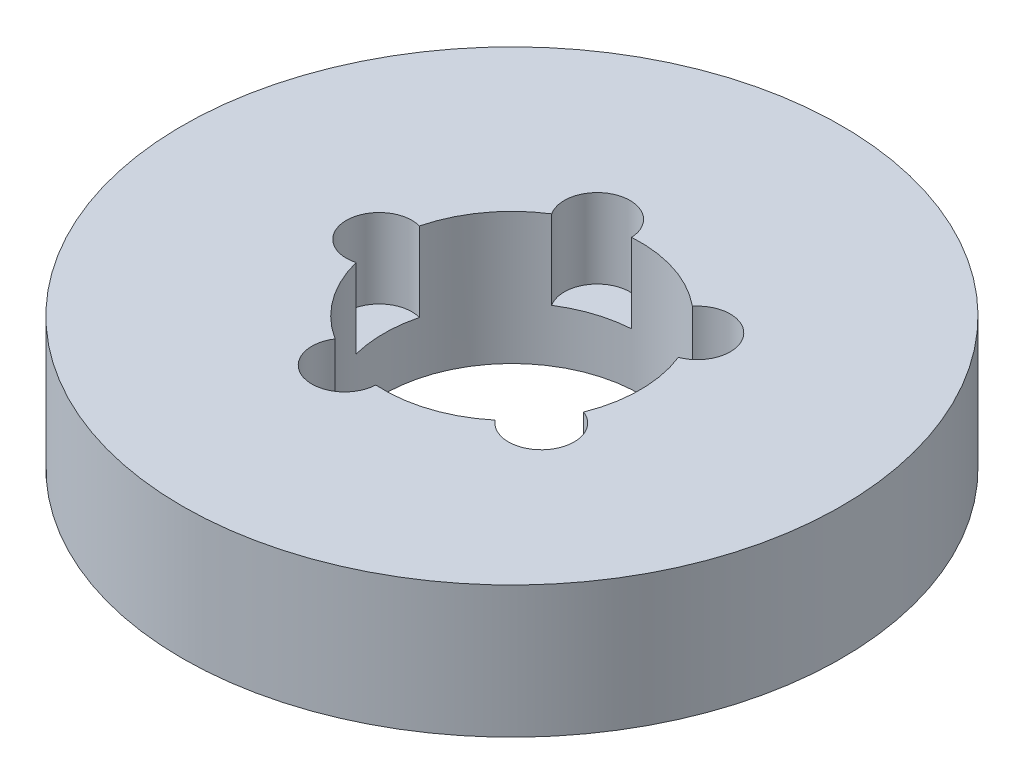
ISO-10303-21;
HEADER;
FILE_DESCRIPTION(('STEP AP214'),'2;1');
FILE_NAME('part.step','',(''),(''),'','','');
FILE_SCHEMA(('AUTOMOTIVE_DESIGN { 1 0 10303 214 1 1 1 1 }'));
ENDSEC;
DATA;
#1=APPLICATION_CONTEXT('core data for automotive mechanical design processes');
#2=APPLICATION_PROTOCOL_DEFINITION('international standard','automotive_design',2000,#1);
#3=PRODUCT_CONTEXT('',#1,'mechanical');
#4=PRODUCT('Part','Part','',(#3));
#5=PRODUCT_RELATED_PRODUCT_CATEGORY('part','',(#4));
#6=PRODUCT_DEFINITION_FORMATION('','',#4);
#7=PRODUCT_DEFINITION_CONTEXT('part definition',#1,'design');
#8=PRODUCT_DEFINITION('design','',#6,#7);
#9=PRODUCT_DEFINITION_SHAPE('','',#8);
#10=(LENGTH_UNIT() NAMED_UNIT(*) SI_UNIT(.MILLI.,.METRE.));
#11=(NAMED_UNIT(*) PLANE_ANGLE_UNIT() SI_UNIT($,.RADIAN.));
#12=(NAMED_UNIT(*) SI_UNIT($,.STERADIAN.) SOLID_ANGLE_UNIT());
#13=UNCERTAINTY_MEASURE_WITH_UNIT(LENGTH_MEASURE(1.E-05),#10,'distance_accuracy_value','');
#14=(GEOMETRIC_REPRESENTATION_CONTEXT(3) GLOBAL_UNCERTAINTY_ASSIGNED_CONTEXT((#13)) GLOBAL_UNIT_ASSIGNED_CONTEXT((#10,
#11,#12)) REPRESENTATION_CONTEXT('',''));
#15=CARTESIAN_POINT('',(0.,0.,0.));
#16=DIRECTION('',(0.,0.,1.));
#17=DIRECTION('',(1.,0.,0.));
#18=AXIS2_PLACEMENT_3D('',#15,#16,#17);
#19=CARTESIAN_POINT('',(0.,18.,0.));
#20=DIRECTION('',(0.,-1.,0.));
#21=DIRECTION('',(0.,0.,-1.));
#22=AXIS2_PLACEMENT_3D('',#19,#20,#21);
#23=CYLINDRICAL_SURFACE('',#22,45.);
#24=CARTESIAN_POINT('',(0.,18.,0.));
#25=DIRECTION('',(0.,1.,0.));
#26=DIRECTION('',(0.,0.,1.));
#27=AXIS2_PLACEMENT_3D('',#24,#25,#26);
#28=CIRCLE('',#27,45.);
#29=CARTESIAN_POINT('',(0.,18.,45.));
#30=VERTEX_POINT('',#29);
#31=EDGE_CURVE('E157',#30,#30,#28,.T.);
#32=ORIENTED_EDGE('',*,*,#31,.F.);
#33=EDGE_LOOP('',(#32));
#34=FACE_BOUND('',#33,.T.);
#35=CARTESIAN_POINT('',(0.,0.,0.));
#36=DIRECTION('',(0.,1.,0.));
#37=DIRECTION('',(0.,0.,1.));
#38=AXIS2_PLACEMENT_3D('',#35,#36,#37);
#39=CIRCLE('',#38,45.);
#40=CARTESIAN_POINT('',(0.,0.,45.));
#41=VERTEX_POINT('',#40);
#42=EDGE_CURVE('E150',#41,#41,#39,.T.);
#43=ORIENTED_EDGE('',*,*,#42,.T.);
#44=EDGE_LOOP('',(#43));
#45=FACE_BOUND('',#44,.T.);
#46=ADVANCED_FACE('F39',(#34,#45),#23,.T.);
#47=CARTESIAN_POINT('',(0.,18.,0.));
#48=DIRECTION('',(0.,1.,0.));
#49=DIRECTION('',(0.,0.,1.));
#50=AXIS2_PLACEMENT_3D('',#47,#48,#49);
#51=PLANE('',#50);
#52=CARTESIAN_POINT('',(-5.60135320478435,18.,-17.239192544268));
#53=DIRECTION('',(0.,1.,0.));
#54=DIRECTION('',(-0.95105651629515,0.,0.309016994374958));
#55=AXIS2_PLACEMENT_3D('',#52,#53,#54);
#56=CIRCLE('',#55,4.48336680824635);
#57=CARTESIAN_POINT('',(-1.123620664871,18.,-17.4638906490357));
#58=VERTEX_POINT('',#57);
#59=CARTESIAN_POINT('',(-9.35598915804041,18.,-14.7890319789576));
#60=VERTEX_POINT('',#59);
#61=EDGE_CURVE('E194',#58,#60,#56,.T.);
#62=ORIENTED_EDGE('',*,*,#61,.F.);
#63=CARTESIAN_POINT('',(0.,18.,0.));
#64=DIRECTION('',(0.,1.,0.));
#65=DIRECTION('',(0.,0.,1.));
#66=AXIS2_PLACEMENT_3D('',#63,#64,#65);
#67=CIRCLE('',#66,17.5);
#68=CARTESIAN_POINT('',(11.1740455842628,18.,-13.4681366669936));
#69=VERTEX_POINT('',#68);
#70=EDGE_CURVE('E147',#69,#58,#67,.T.);
#71=ORIENTED_EDGE('',*,*,#70,.F.);
#72=CARTESIAN_POINT('',(14.664533073118,18.,-10.6544069309616));
#73=DIRECTION('',(0.,1.,0.));
#74=DIRECTION('',(-0.58778525229248,0.,-0.809016994374942));
#75=AXIS2_PLACEMENT_3D('',#72,#73,#74);
#76=CIRCLE('',#75,4.48336680824635);
#77=CARTESIAN_POINT('',(16.2619291209554,18.,-6.46526575362716));
#78=VERTEX_POINT('',#77);
#79=EDGE_CURVE('E254',#78,#69,#76,.T.);
#80=ORIENTED_EDGE('',*,*,#79,.F.);
#81=CARTESIAN_POINT('',(16.2619291209555,18.,6.46526575362693));
#82=VERTEX_POINT('',#81);
#83=EDGE_CURVE('E144',#82,#78,#67,.T.);
#84=ORIENTED_EDGE('',*,*,#83,.F.);
#85=CARTESIAN_POINT('',(14.6645330731181,18.,10.6544069309613));
#86=DIRECTION('',(0.,1.,0.));
#87=DIRECTION('',(0.587785252292469,0.,-0.809016994374951));
#88=AXIS2_PLACEMENT_3D('',#85,#86,#87);
#89=CIRCLE('',#88,4.48336680824635);
#90=CARTESIAN_POINT('',(11.174045584263,18.,13.4681366669934));
#91=VERTEX_POINT('',#90);
#92=EDGE_CURVE('E141',#91,#82,#89,.T.);
#93=ORIENTED_EDGE('',*,*,#92,.F.);
#94=CARTESIAN_POINT('',(-1.12362066487075,18.,17.4638906490357));
#95=VERTEX_POINT('',#94);
#96=EDGE_CURVE('E134',#95,#91,#67,.T.);
#97=ORIENTED_EDGE('',*,*,#96,.F.);
#98=CARTESIAN_POINT('',(-5.60135320478411,18.,17.2391925442681));
#99=DIRECTION('',(0.,1.,0.));
#100=DIRECTION('',(0.951056516295155,0.,0.309016994374945));
#101=AXIS2_PLACEMENT_3D('',#98,#99,#100);
#102=CIRCLE('',#101,4.48336680824635);
#103=CARTESIAN_POINT('',(-9.3559891580402,18.,14.7890319789577));
#104=VERTEX_POINT('',#103);
#105=EDGE_CURVE('E111',#104,#95,#102,.T.);
#106=ORIENTED_EDGE('',*,*,#105,.F.);
#107=CARTESIAN_POINT('',(-16.9563648823073,18.,4.32801224328849));
#108=VERTEX_POINT('',#107);
#109=EDGE_CURVE('E145',#108,#104,#67,.T.);
#110=ORIENTED_EDGE('',*,*,#109,.F.);
#111=CARTESIAN_POINT('',(-18.1263597366678,18.,0.));
#112=DIRECTION('',(0.,1.,0.));
#113=DIRECTION('',(0.,0.,1.));
#114=AXIS2_PLACEMENT_3D('',#111,#112,#113);
#115=CIRCLE('',#114,4.48336680824635);
#116=CARTESIAN_POINT('',(-16.9563648823073,18.,-4.32801224328849));
#117=VERTEX_POINT('',#116);
#118=EDGE_CURVE('E153',#117,#108,#115,.T.);
#119=ORIENTED_EDGE('',*,*,#118,.F.);
#120=EDGE_CURVE('E146',#60,#117,#67,.T.);
#121=ORIENTED_EDGE('',*,*,#120,.F.);
#122=EDGE_LOOP('',(#62,#71,#80,#84,#93,#97,#106,#110,#119,#121));
#123=FACE_BOUND('',#122,.T.);
#124=ORIENTED_EDGE('',*,*,#31,.T.);
#125=EDGE_LOOP('',(#124));
#126=FACE_BOUND('',#125,.T.);
#127=ADVANCED_FACE('F139',(#123,#126),#51,.T.);
#128=CARTESIAN_POINT('',(0.,0.,0.));
#129=DIRECTION('',(0.,1.,0.));
#130=DIRECTION('',(0.,0.,1.));
#131=AXIS2_PLACEMENT_3D('',#128,#129,#130);
#132=PLANE('',#131);
#133=CARTESIAN_POINT('',(0.,0.,0.));
#134=DIRECTION('',(0.,1.,0.));
#135=DIRECTION('',(0.,0.,1.));
#136=AXIS2_PLACEMENT_3D('',#133,#134,#135);
#137=CIRCLE('',#136,17.5);
#138=CARTESIAN_POINT('',(0.,0.,17.5));
#139=VERTEX_POINT('',#138);
#140=EDGE_CURVE('E154',#139,#139,#137,.T.);
#141=ORIENTED_EDGE('',*,*,#140,.T.);
#142=EDGE_LOOP('',(#141));
#143=FACE_BOUND('',#142,.T.);
#144=ORIENTED_EDGE('',*,*,#42,.F.);
#145=EDGE_LOOP('',(#144));
#146=FACE_BOUND('',#145,.T.);
#147=ADVANCED_FACE('F213',(#143,#146),#132,.F.);
#148=CARTESIAN_POINT('',(0.,18.,0.));
#149=DIRECTION('',(0.,-1.,0.));
#150=DIRECTION('',(0.,0.,-1.));
#151=AXIS2_PLACEMENT_3D('',#148,#149,#150);
#152=CYLINDRICAL_SURFACE('',#151,17.5);
#153=DIRECTION('',(0.,1.,0.));
#154=VECTOR('',#153,1.);
#155=CARTESIAN_POINT('',(-1.123620664871,12.5904140749818,-17.4638906490357));
#156=LINE('',#155,#154);
#157=CARTESIAN_POINT('',(-1.123620664871,7.18082814996363,-17.4638906490357));
#158=VERTEX_POINT('',#157);
#159=EDGE_CURVE('E11',#158,#58,#156,.T.);
#160=ORIENTED_EDGE('',*,*,#159,.F.);
#161=CARTESIAN_POINT('',(0.,7.18082814996363,0.));
#162=DIRECTION('',(0.,1.,0.));
#163=DIRECTION('',(0.,0.,1.));
#164=AXIS2_PLACEMENT_3D('',#161,#162,#163);
#165=CIRCLE('',#164,17.5);
#166=CARTESIAN_POINT('',(-9.35598915804041,7.18082814996363,-14.7890319789576));
#167=VERTEX_POINT('',#166);
#168=EDGE_CURVE('E189',#158,#167,#165,.T.);
#169=ORIENTED_EDGE('',*,*,#168,.T.);
#170=DIRECTION('',(0.,1.,0.));
#171=VECTOR('',#170,1.);
#172=CARTESIAN_POINT('',(-9.35598915804041,12.5904140749818,-14.7890319789576));
#173=LINE('',#172,#171);
#174=EDGE_CURVE('E46',#60,#167,#173,.F.);
#175=ORIENTED_EDGE('',*,*,#174,.F.);
#176=ORIENTED_EDGE('',*,*,#120,.T.);
#177=DIRECTION('',(0.,1.,0.));
#178=VECTOR('',#177,1.);
#179=CARTESIAN_POINT('',(-16.9563648823073,12.5904140749818,-4.32801224328849));
#180=LINE('',#179,#178);
#181=CARTESIAN_POINT('',(-16.9563648823073,7.18082814996363,-4.32801224328849));
#182=VERTEX_POINT('',#181);
#183=EDGE_CURVE('E168',#182,#117,#180,.T.);
#184=ORIENTED_EDGE('',*,*,#183,.F.);
#185=CARTESIAN_POINT('',(0.,7.18082814996363,0.));
#186=DIRECTION('',(0.,1.,0.));
#187=DIRECTION('',(0.,0.,1.));
#188=AXIS2_PLACEMENT_3D('',#185,#186,#187);
#189=CIRCLE('',#188,17.5);
#190=CARTESIAN_POINT('',(-16.9563648823073,7.18082814996363,4.32801224328849));
#191=VERTEX_POINT('',#190);
#192=EDGE_CURVE('E165',#182,#191,#189,.T.);
#193=ORIENTED_EDGE('',*,*,#192,.T.);
#194=DIRECTION('',(0.,1.,0.));
#195=VECTOR('',#194,1.);
#196=CARTESIAN_POINT('',(-16.9563648823073,12.5904140749818,4.32801224328849));
#197=LINE('',#196,#195);
#198=EDGE_CURVE('E170',#108,#191,#197,.F.);
#199=ORIENTED_EDGE('',*,*,#198,.F.);
#200=ORIENTED_EDGE('',*,*,#109,.T.);
#201=DIRECTION('',(0.,1.,0.));
#202=VECTOR('',#201,1.);
#203=CARTESIAN_POINT('',(-9.3559891580402,12.5904140749818,14.7890319789577));
#204=LINE('',#203,#202);
#205=CARTESIAN_POINT('',(-9.3559891580402,7.18082814996363,14.7890319789577));
#206=VERTEX_POINT('',#205);
#207=EDGE_CURVE('E121',#206,#104,#204,.T.);
#208=ORIENTED_EDGE('',*,*,#207,.F.);
#209=CARTESIAN_POINT('',(0.,7.18082814996363,0.));
#210=DIRECTION('',(0.,1.,0.));
#211=DIRECTION('',(0.,0.,1.));
#212=AXIS2_PLACEMENT_3D('',#209,#210,#211);
#213=CIRCLE('',#212,17.5);
#214=CARTESIAN_POINT('',(-1.12362066487075,7.18082814996363,17.4638906490357));
#215=VERTEX_POINT('',#214);
#216=EDGE_CURVE('E136',#206,#215,#213,.T.);
#217=ORIENTED_EDGE('',*,*,#216,.T.);
#218=DIRECTION('',(0.,1.,0.));
#219=VECTOR('',#218,1.);
#220=CARTESIAN_POINT('',(-1.12362066487075,12.5904140749818,17.4638906490357));
#221=LINE('',#220,#219);
#222=EDGE_CURVE('E117',#95,#215,#221,.F.);
#223=ORIENTED_EDGE('',*,*,#222,.F.);
#224=ORIENTED_EDGE('',*,*,#96,.T.);
#225=DIRECTION('',(0.,1.,0.));
#226=VECTOR('',#225,1.);
#227=CARTESIAN_POINT('',(11.174045584263,12.5904140749818,13.4681366669934));
#228=LINE('',#227,#226);
#229=CARTESIAN_POINT('',(11.174045584263,7.18082814996363,13.4681366669934));
#230=VERTEX_POINT('',#229);
#231=EDGE_CURVE('E182',#230,#91,#228,.T.);
#232=ORIENTED_EDGE('',*,*,#231,.F.);
#233=CARTESIAN_POINT('',(0.,7.18082814996363,0.));
#234=DIRECTION('',(0.,1.,0.));
#235=DIRECTION('',(0.,0.,1.));
#236=AXIS2_PLACEMENT_3D('',#233,#234,#235);
#237=CIRCLE('',#236,17.5);
#238=CARTESIAN_POINT('',(16.2619291209555,7.18082814996363,6.46526575362693));
#239=VERTEX_POINT('',#238);
#240=EDGE_CURVE('E174',#230,#239,#237,.T.);
#241=ORIENTED_EDGE('',*,*,#240,.T.);
#242=DIRECTION('',(0.,1.,0.));
#243=VECTOR('',#242,1.);
#244=CARTESIAN_POINT('',(16.2619291209555,12.5904140749818,6.46526575362692));
#245=LINE('',#244,#243);
#246=EDGE_CURVE('E177',#82,#239,#245,.F.);
#247=ORIENTED_EDGE('',*,*,#246,.F.);
#248=ORIENTED_EDGE('',*,*,#83,.T.);
#249=DIRECTION('',(0.,1.,0.));
#250=VECTOR('',#249,1.);
#251=CARTESIAN_POINT('',(16.2619291209554,12.5904140749818,-6.46526575362716));
#252=LINE('',#251,#250);
#253=CARTESIAN_POINT('',(16.2619291209554,7.18082814996363,-6.46526575362716));
#254=VERTEX_POINT('',#253);
#255=EDGE_CURVE('E187',#254,#78,#252,.T.);
#256=ORIENTED_EDGE('',*,*,#255,.F.);
#257=CARTESIAN_POINT('',(0.,7.18082814996363,0.));
#258=DIRECTION('',(0.,1.,0.));
#259=DIRECTION('',(0.,0.,1.));
#260=AXIS2_PLACEMENT_3D('',#257,#258,#259);
#261=CIRCLE('',#260,17.5);
#262=CARTESIAN_POINT('',(11.1740455842628,7.18082814996363,-13.4681366669936));
#263=VERTEX_POINT('',#262);
#264=EDGE_CURVE('E181',#254,#263,#261,.T.);
#265=ORIENTED_EDGE('',*,*,#264,.T.);
#266=DIRECTION('',(0.,1.,0.));
#267=VECTOR('',#266,1.);
#268=CARTESIAN_POINT('',(11.1740455842628,12.5904140749818,-13.4681366669936));
#269=LINE('',#268,#267);
#270=EDGE_CURVE('E186',#69,#263,#269,.F.);
#271=ORIENTED_EDGE('',*,*,#270,.F.);
#272=ORIENTED_EDGE('',*,*,#70,.T.);
#273=EDGE_LOOP('',(#160,#169,#175,#176,#184,#193,#199,#200,#208,#217,#223,#224,#232,#241,#247,
#248,#256,#265,#271,#272));
#274=FACE_BOUND('',#273,.T.);
#275=ORIENTED_EDGE('',*,*,#140,.F.);
#276=EDGE_LOOP('',(#275));
#277=FACE_BOUND('',#276,.T.);
#278=ADVANCED_FACE('F135',(#274,#277),#152,.F.);
#279=CARTESIAN_POINT('',(-18.1263597366678,7.18082814996363,0.));
#280=DIRECTION('',(0.,1.,0.));
#281=DIRECTION('',(0.,0.,1.));
#282=AXIS2_PLACEMENT_3D('',#279,#280,#281);
#283=CYLINDRICAL_SURFACE('',#282,4.48336680824635);
#284=ORIENTED_EDGE('',*,*,#183,.T.);
#285=ORIENTED_EDGE('',*,*,#118,.T.);
#286=ORIENTED_EDGE('',*,*,#198,.T.);
#287=CARTESIAN_POINT('',(-18.1263597366678,7.18082814996363,0.));
#288=DIRECTION('',(0.,1.,0.));
#289=DIRECTION('',(0.,0.,1.));
#290=AXIS2_PLACEMENT_3D('',#287,#288,#289);
#291=CIRCLE('',#290,4.48336680824635);
#292=EDGE_CURVE('E158',#182,#191,#291,.T.);
#293=ORIENTED_EDGE('',*,*,#292,.F.);
#294=EDGE_LOOP('',(#284,#285,#286,#293));
#295=FACE_BOUND('',#294,.T.);
#296=ADVANCED_FACE('F221',(#295),#283,.F.);
#297=CARTESIAN_POINT('',(-18.1263597366678,7.18082814996363,0.));
#298=DIRECTION('',(0.,1.,0.));
#299=DIRECTION('',(0.,0.,1.));
#300=AXIS2_PLACEMENT_3D('',#297,#298,#299);
#301=PLANE('',#300);
#302=ORIENTED_EDGE('',*,*,#292,.T.);
#303=ORIENTED_EDGE('',*,*,#192,.F.);
#304=EDGE_LOOP('',(#302,#303));
#305=FACE_BOUND('',#304,.T.);
#306=ADVANCED_FACE('F227',(#305),#301,.T.);
#307=CARTESIAN_POINT('',(-5.60135320478411,7.18082814996363,17.2391925442681));
#308=DIRECTION('',(0.,1.,0.));
#309=DIRECTION('',(0.,0.,1.));
#310=AXIS2_PLACEMENT_3D('',#307,#308,#309);
#311=CYLINDRICAL_SURFACE('',#310,4.48336680824635);
#312=ORIENTED_EDGE('',*,*,#207,.T.);
#313=ORIENTED_EDGE('',*,*,#105,.T.);
#314=ORIENTED_EDGE('',*,*,#222,.T.);
#315=CARTESIAN_POINT('',(-5.60135320478411,7.18082814996363,17.2391925442681));
#316=DIRECTION('',(0.,1.,0.));
#317=DIRECTION('',(0.951056516295155,0.,0.309016994374945));
#318=AXIS2_PLACEMENT_3D('',#315,#316,#317);
#319=CIRCLE('',#318,4.48336680824635);
#320=EDGE_CURVE('E127',#206,#215,#319,.T.);
#321=ORIENTED_EDGE('',*,*,#320,.F.);
#322=EDGE_LOOP('',(#312,#313,#314,#321));
#323=FACE_BOUND('',#322,.T.);
#324=ADVANCED_FACE('F116',(#323),#311,.F.);
#325=CARTESIAN_POINT('',(-5.60135320478411,7.18082814996363,17.2391925442681));
#326=DIRECTION('',(0.,1.,0.));
#327=DIRECTION('',(0.951056516295155,0.,0.309016994374945));
#328=AXIS2_PLACEMENT_3D('',#325,#326,#327);
#329=PLANE('',#328);
#330=ORIENTED_EDGE('',*,*,#320,.T.);
#331=ORIENTED_EDGE('',*,*,#216,.F.);
#332=EDGE_LOOP('',(#330,#331));
#333=FACE_BOUND('',#332,.T.);
#334=ADVANCED_FACE('F234',(#333),#329,.T.);
#335=CARTESIAN_POINT('',(14.6645330731181,7.18082814996363,10.6544069309613));
#336=DIRECTION('',(0.,1.,0.));
#337=DIRECTION('',(0.,0.,1.));
#338=AXIS2_PLACEMENT_3D('',#335,#336,#337);
#339=CYLINDRICAL_SURFACE('',#338,4.48336680824635);
#340=ORIENTED_EDGE('',*,*,#231,.T.);
#341=ORIENTED_EDGE('',*,*,#92,.T.);
#342=ORIENTED_EDGE('',*,*,#246,.T.);
#343=CARTESIAN_POINT('',(14.6645330731181,7.18082814996363,10.6544069309613));
#344=DIRECTION('',(0.,1.,0.));
#345=DIRECTION('',(0.587785252292469,0.,-0.809016994374951));
#346=AXIS2_PLACEMENT_3D('',#343,#344,#345);
#347=CIRCLE('',#346,4.48336680824635);
#348=EDGE_CURVE('E130',#230,#239,#347,.T.);
#349=ORIENTED_EDGE('',*,*,#348,.F.);
#350=EDGE_LOOP('',(#340,#341,#342,#349));
#351=FACE_BOUND('',#350,.T.);
#352=ADVANCED_FACE('F240',(#351),#339,.F.);
#353=CARTESIAN_POINT('',(14.6645330731181,7.18082814996363,10.6544069309613));
#354=DIRECTION('',(0.,1.,0.));
#355=DIRECTION('',(0.587785252292469,0.,-0.809016994374951));
#356=AXIS2_PLACEMENT_3D('',#353,#354,#355);
#357=PLANE('',#356);
#358=ORIENTED_EDGE('',*,*,#348,.T.);
#359=ORIENTED_EDGE('',*,*,#240,.F.);
#360=EDGE_LOOP('',(#358,#359));
#361=FACE_BOUND('',#360,.T.);
#362=ADVANCED_FACE('F245',(#361),#357,.T.);
#363=CARTESIAN_POINT('',(14.664533073118,7.18082814996363,-10.6544069309616));
#364=DIRECTION('',(0.,1.,0.));
#365=DIRECTION('',(0.,0.,1.));
#366=AXIS2_PLACEMENT_3D('',#363,#364,#365);
#367=CYLINDRICAL_SURFACE('',#366,4.48336680824635);
#368=ORIENTED_EDGE('',*,*,#255,.T.);
#369=ORIENTED_EDGE('',*,*,#79,.T.);
#370=ORIENTED_EDGE('',*,*,#270,.T.);
#371=CARTESIAN_POINT('',(14.664533073118,7.18082814996363,-10.6544069309616));
#372=DIRECTION('',(0.,1.,0.));
#373=DIRECTION('',(-0.58778525229248,0.,-0.809016994374942));
#374=AXIS2_PLACEMENT_3D('',#371,#372,#373);
#375=CIRCLE('',#374,4.48336680824635);
#376=EDGE_CURVE('E56',#254,#263,#375,.T.);
#377=ORIENTED_EDGE('',*,*,#376,.F.);
#378=EDGE_LOOP('',(#368,#369,#370,#377));
#379=FACE_BOUND('',#378,.T.);
#380=ADVANCED_FACE('F266',(#379),#367,.F.);
#381=CARTESIAN_POINT('',(14.664533073118,7.18082814996363,-10.6544069309616));
#382=DIRECTION('',(0.,1.,0.));
#383=DIRECTION('',(-0.58778525229248,0.,-0.809016994374942));
#384=AXIS2_PLACEMENT_3D('',#381,#382,#383);
#385=PLANE('',#384);
#386=ORIENTED_EDGE('',*,*,#376,.T.);
#387=ORIENTED_EDGE('',*,*,#264,.F.);
#388=EDGE_LOOP('',(#386,#387));
#389=FACE_BOUND('',#388,.T.);
#390=ADVANCED_FACE('F204',(#389),#385,.T.);
#391=CARTESIAN_POINT('',(-5.60135320478435,7.18082814996363,-17.239192544268));
#392=DIRECTION('',(0.,1.,0.));
#393=DIRECTION('',(0.,0.,1.));
#394=AXIS2_PLACEMENT_3D('',#391,#392,#393);
#395=CYLINDRICAL_SURFACE('',#394,4.48336680824635);
#396=ORIENTED_EDGE('',*,*,#159,.T.);
#397=ORIENTED_EDGE('',*,*,#61,.T.);
#398=ORIENTED_EDGE('',*,*,#174,.T.);
#399=CARTESIAN_POINT('',(-5.60135320478435,7.18082814996363,-17.239192544268));
#400=DIRECTION('',(0.,1.,0.));
#401=DIRECTION('',(-0.95105651629515,0.,0.309016994374958));
#402=AXIS2_PLACEMENT_3D('',#399,#400,#401);
#403=CIRCLE('',#402,4.48336680824635);
#404=EDGE_CURVE('E55',#158,#167,#403,.T.);
#405=ORIENTED_EDGE('',*,*,#404,.F.);
#406=EDGE_LOOP('',(#396,#397,#398,#405));
#407=FACE_BOUND('',#406,.T.);
#408=ADVANCED_FACE('F193',(#407),#395,.F.);
#409=CARTESIAN_POINT('',(-5.60135320478435,7.18082814996363,-17.239192544268));
#410=DIRECTION('',(0.,1.,0.));
#411=DIRECTION('',(-0.95105651629515,0.,0.309016994374958));
#412=AXIS2_PLACEMENT_3D('',#409,#410,#411);
#413=PLANE('',#412);
#414=ORIENTED_EDGE('',*,*,#404,.T.);
#415=ORIENTED_EDGE('',*,*,#168,.F.);
#416=EDGE_LOOP('',(#414,#415));
#417=FACE_BOUND('',#416,.T.);
#418=ADVANCED_FACE('F196',(#417),#413,.T.);
#419=CLOSED_SHELL('',(#46,#127,#147,#278,#296,#306,#324,#334,#352,#362,#380,#390,#408,#418));
#420=MANIFOLD_SOLID_BREP('B2',#419);
#421=ADVANCED_BREP_SHAPE_REPRESENTATION('',(#18,#420),#14);
#422=SHAPE_DEFINITION_REPRESENTATION(#9,#421);
ENDSEC;
END-ISO-10303-21;
